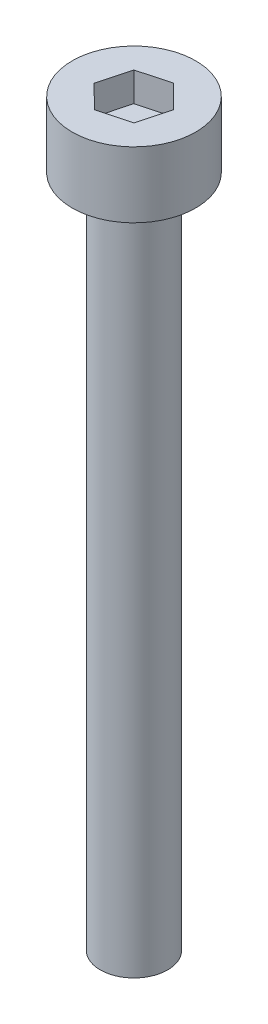
ISO-10303-21;
HEADER;
FILE_DESCRIPTION(('STEP AP214'),'2;1');
FILE_NAME('part.step','',(''),(''),'','','');
FILE_SCHEMA(('AUTOMOTIVE_DESIGN { 1 0 10303 214 1 1 1 1 }'));
ENDSEC;
DATA;
#1=APPLICATION_CONTEXT('core data for automotive mechanical design processes');
#2=APPLICATION_PROTOCOL_DEFINITION('international standard','automotive_design',2000,#1);
#3=PRODUCT_CONTEXT('',#1,'mechanical');
#4=PRODUCT('Part','Part','',(#3));
#5=PRODUCT_RELATED_PRODUCT_CATEGORY('part','',(#4));
#6=PRODUCT_DEFINITION_FORMATION('','',#4);
#7=PRODUCT_DEFINITION_CONTEXT('part definition',#1,'design');
#8=PRODUCT_DEFINITION('design','',#6,#7);
#9=PRODUCT_DEFINITION_SHAPE('','',#8);
#10=(LENGTH_UNIT() NAMED_UNIT(*) SI_UNIT(.MILLI.,.METRE.));
#11=(NAMED_UNIT(*) PLANE_ANGLE_UNIT() SI_UNIT($,.RADIAN.));
#12=(NAMED_UNIT(*) SI_UNIT($,.STERADIAN.) SOLID_ANGLE_UNIT());
#13=UNCERTAINTY_MEASURE_WITH_UNIT(LENGTH_MEASURE(1.E-05),#10,'distance_accuracy_value','');
#14=(GEOMETRIC_REPRESENTATION_CONTEXT(3) GLOBAL_UNCERTAINTY_ASSIGNED_CONTEXT((#13)) GLOBAL_UNIT_ASSIGNED_CONTEXT((#10,
#11,#12)) REPRESENTATION_CONTEXT('',''));
#15=CARTESIAN_POINT('',(0.,0.,0.));
#16=DIRECTION('',(0.,0.,1.));
#17=DIRECTION('',(1.,0.,0.));
#18=AXIS2_PLACEMENT_3D('',#15,#16,#17);
#19=CARTESIAN_POINT('',(0.,30.,0.));
#20=DIRECTION('',(0.,-1.,0.));
#21=DIRECTION('',(0.,0.,-1.));
#22=AXIS2_PLACEMENT_3D('',#19,#20,#21);
#23=CYLINDRICAL_SURFACE('',#22,1.5);
#24=CARTESIAN_POINT('',(0.,30.,0.));
#25=DIRECTION('',(0.,1.,0.));
#26=DIRECTION('',(0.,0.,1.));
#27=AXIS2_PLACEMENT_3D('',#24,#25,#26);
#28=CIRCLE('',#27,1.5);
#29=CARTESIAN_POINT('',(0.,30.,1.5));
#30=VERTEX_POINT('',#29);
#31=EDGE_CURVE('E11',#30,#30,#28,.T.);
#32=ORIENTED_EDGE('',*,*,#31,.F.);
#33=EDGE_LOOP('',(#32));
#34=FACE_BOUND('',#33,.T.);
#35=CARTESIAN_POINT('',(0.,0.,0.));
#36=DIRECTION('',(0.,1.,0.));
#37=DIRECTION('',(0.,0.,1.));
#38=AXIS2_PLACEMENT_3D('',#35,#36,#37);
#39=CIRCLE('',#38,1.5);
#40=CARTESIAN_POINT('',(0.,0.,1.5));
#41=VERTEX_POINT('',#40);
#42=EDGE_CURVE('E42',#41,#41,#39,.T.);
#43=ORIENTED_EDGE('',*,*,#42,.T.);
#44=EDGE_LOOP('',(#43));
#45=FACE_BOUND('',#44,.T.);
#46=ADVANCED_FACE('F39',(#34,#45),#23,.T.);
#47=CARTESIAN_POINT('',(0.,0.,0.));
#48=DIRECTION('',(0.,1.,0.));
#49=DIRECTION('',(0.,0.,1.));
#50=AXIS2_PLACEMENT_3D('',#47,#48,#49);
#51=PLANE('',#50);
#52=ORIENTED_EDGE('',*,*,#42,.F.);
#53=EDGE_LOOP('',(#52));
#54=FACE_BOUND('',#53,.T.);
#55=ADVANCED_FACE('F189',(#54),#51,.F.);
#56=CARTESIAN_POINT('',(0.,32.93,0.));
#57=DIRECTION('',(0.,-1.,0.));
#58=DIRECTION('',(0.,0.,-1.));
#59=AXIS2_PLACEMENT_3D('',#56,#57,#58);
#60=CYLINDRICAL_SURFACE('',#59,2.75);
#61=CARTESIAN_POINT('',(0.,32.93,0.));
#62=DIRECTION('',(0.,1.,0.));
#63=DIRECTION('',(0.,0.,1.));
#64=AXIS2_PLACEMENT_3D('',#61,#62,#63);
#65=CIRCLE('',#64,2.75);
#66=CARTESIAN_POINT('',(0.,32.93,2.75));
#67=VERTEX_POINT('',#66);
#68=EDGE_CURVE('E163',#67,#67,#65,.T.);
#69=ORIENTED_EDGE('',*,*,#68,.F.);
#70=EDGE_LOOP('',(#69));
#71=FACE_BOUND('',#70,.T.);
#72=CARTESIAN_POINT('',(0.,30.,0.));
#73=DIRECTION('',(0.,1.,0.));
#74=DIRECTION('',(0.,0.,1.));
#75=AXIS2_PLACEMENT_3D('',#72,#73,#74);
#76=CIRCLE('',#75,2.75);
#77=CARTESIAN_POINT('',(0.,30.,2.75));
#78=VERTEX_POINT('',#77);
#79=EDGE_CURVE('E153',#78,#78,#76,.T.);
#80=ORIENTED_EDGE('',*,*,#79,.T.);
#81=EDGE_LOOP('',(#80));
#82=FACE_BOUND('',#81,.T.);
#83=ADVANCED_FACE('F171',(#71,#82),#60,.T.);
#84=CARTESIAN_POINT('',(0.,32.93,0.));
#85=DIRECTION('',(0.,1.,0.));
#86=DIRECTION('',(0.,0.,1.));
#87=AXIS2_PLACEMENT_3D('',#84,#85,#86);
#88=PLANE('',#87);
#89=DIRECTION('',(0.965060636483616,0.,-0.262026654960595));
#90=VECTOR('',#89,1.);
#91=CARTESIAN_POINT('',(-0.368939204121915,32.93,1.39542724532497));
#92=LINE('',#91,#90);
#93=CARTESIAN_POINT('',(-0.368939204121915,32.93,1.39542724532497));
#94=VERTEX_POINT('',#93);
#95=CARTESIAN_POINT('',(1.0240058415234,32.93,1.01722434588407));
#96=VERTEX_POINT('',#95);
#97=EDGE_CURVE('E54',#94,#96,#92,.T.);
#98=ORIENTED_EDGE('',*,*,#97,.F.);
#99=DIRECTION('',(0.709452057906343,0.,0.704753699906893));
#100=VECTOR('',#99,1.);
#101=CARTESIAN_POINT('',(-1.39294504564532,32.93,0.378202899440891));
#102=LINE('',#101,#100);
#103=CARTESIAN_POINT('',(-1.39294504564532,32.93,0.378202899440891));
#104=VERTEX_POINT('',#103);
#105=EDGE_CURVE('E147',#104,#94,#102,.T.);
#106=ORIENTED_EDGE('',*,*,#105,.F.);
#107=DIRECTION('',(-0.255608578577273,0.,0.966780354867488));
#108=VECTOR('',#107,1.);
#109=CARTESIAN_POINT('',(-1.0240058415234,32.93,-1.01722434588407));
#110=LINE('',#109,#108);
#111=CARTESIAN_POINT('',(-1.0240058415234,32.93,-1.01722434588407));
#112=VERTEX_POINT('',#111);
#113=EDGE_CURVE('E144',#112,#104,#110,.T.);
#114=ORIENTED_EDGE('',*,*,#113,.F.);
#115=DIRECTION('',(-0.965060636483616,0.,0.262026654960595));
#116=VECTOR('',#115,1.);
#117=CARTESIAN_POINT('',(0.368939204121915,32.93,-1.39542724532496));
#118=LINE('',#117,#116);
#119=CARTESIAN_POINT('',(0.368939204121915,32.93,-1.39542724532496));
#120=VERTEX_POINT('',#119);
#121=EDGE_CURVE('E102',#120,#112,#118,.T.);
#122=ORIENTED_EDGE('',*,*,#121,.F.);
#123=DIRECTION('',(-0.709452057906343,0.,-0.704753699906893));
#124=VECTOR('',#123,1.);
#125=CARTESIAN_POINT('',(1.39294504564532,32.93,-0.378202899440891));
#126=LINE('',#125,#124);
#127=CARTESIAN_POINT('',(1.39294504564532,32.93,-0.378202899440891));
#128=VERTEX_POINT('',#127);
#129=EDGE_CURVE('E138',#128,#120,#126,.T.);
#130=ORIENTED_EDGE('',*,*,#129,.F.);
#131=DIRECTION('',(0.255608578577273,0.,-0.966780354867488));
#132=VECTOR('',#131,1.);
#133=CARTESIAN_POINT('',(1.0240058415234,32.93,1.01722434588407));
#134=LINE('',#133,#132);
#135=EDGE_CURVE('E134',#96,#128,#134,.T.);
#136=ORIENTED_EDGE('',*,*,#135,.F.);
#137=EDGE_LOOP('',(#98,#106,#114,#122,#130,#136));
#138=FACE_BOUND('',#137,.T.);
#139=ORIENTED_EDGE('',*,*,#68,.T.);
#140=EDGE_LOOP('',(#139));
#141=FACE_BOUND('',#140,.T.);
#142=ADVANCED_FACE('F176',(#138,#141),#88,.T.);
#143=CARTESIAN_POINT('',(0.,30.,0.));
#144=DIRECTION('',(0.,1.,0.));
#145=DIRECTION('',(0.,0.,1.));
#146=AXIS2_PLACEMENT_3D('',#143,#144,#145);
#147=PLANE('',#146);
#148=ORIENTED_EDGE('',*,*,#31,.T.);
#149=EDGE_LOOP('',(#148));
#150=FACE_BOUND('',#149,.T.);
#151=ORIENTED_EDGE('',*,*,#79,.F.);
#152=EDGE_LOOP('',(#151));
#153=FACE_BOUND('',#152,.T.);
#154=ADVANCED_FACE('F173',(#150,#153),#147,.F.);
#155=CARTESIAN_POINT('',(-0.368939204121915,31.63,1.39542724532497));
#156=DIRECTION('',(0.262026654960595,0.,0.965060636483616));
#157=DIRECTION('',(0.965060636483616,0.,-0.262026654960595));
#158=AXIS2_PLACEMENT_3D('',#155,#156,#157);
#159=PLANE('',#158);
#160=ORIENTED_EDGE('',*,*,#97,.T.);
#161=DIRECTION('',(0.,1.,0.));
#162=VECTOR('',#161,1.);
#163=CARTESIAN_POINT('',(1.0240058415234,31.63,1.01722434588407));
#164=LINE('',#163,#162);
#165=CARTESIAN_POINT('',(1.0240058415234,31.63,1.01722434588407));
#166=VERTEX_POINT('',#165);
#167=EDGE_CURVE('E84',#166,#96,#164,.T.);
#168=ORIENTED_EDGE('',*,*,#167,.F.);
#169=DIRECTION('',(0.965060636483616,0.,-0.262026654960595));
#170=VECTOR('',#169,1.);
#171=CARTESIAN_POINT('',(-0.368939204121915,31.63,1.39542724532497));
#172=LINE('',#171,#170);
#173=CARTESIAN_POINT('',(-0.368939204121915,31.63,1.39542724532497));
#174=VERTEX_POINT('',#173);
#175=EDGE_CURVE('E150',#174,#166,#172,.T.);
#176=ORIENTED_EDGE('',*,*,#175,.F.);
#177=DIRECTION('',(0.,1.,0.));
#178=VECTOR('',#177,1.);
#179=CARTESIAN_POINT('',(-0.368939204121915,31.63,1.39542724532497));
#180=LINE('',#179,#178);
#181=EDGE_CURVE('E62',#174,#94,#180,.T.);
#182=ORIENTED_EDGE('',*,*,#181,.T.);
#183=EDGE_LOOP('',(#160,#168,#176,#182));
#184=FACE_BOUND('',#183,.T.);
#185=ADVANCED_FACE('F175',(#184),#159,.F.);
#186=CARTESIAN_POINT('',(-1.39294504564532,31.63,0.378202899440891));
#187=DIRECTION('',(-0.704753699906893,0.,0.709452057906343));
#188=DIRECTION('',(0.709452057906343,0.,0.704753699906893));
#189=AXIS2_PLACEMENT_3D('',#186,#187,#188);
#190=PLANE('',#189);
#191=ORIENTED_EDGE('',*,*,#105,.T.);
#192=ORIENTED_EDGE('',*,*,#181,.F.);
#193=DIRECTION('',(0.709452057906343,0.,0.704753699906893));
#194=VECTOR('',#193,1.);
#195=CARTESIAN_POINT('',(-1.39294504564532,31.63,0.378202899440891));
#196=LINE('',#195,#194);
#197=CARTESIAN_POINT('',(-1.39294504564532,31.63,0.378202899440891));
#198=VERTEX_POINT('',#197);
#199=EDGE_CURVE('E116',#198,#174,#196,.T.);
#200=ORIENTED_EDGE('',*,*,#199,.F.);
#201=DIRECTION('',(0.,1.,0.));
#202=VECTOR('',#201,1.);
#203=CARTESIAN_POINT('',(-1.39294504564532,31.63,0.378202899440891));
#204=LINE('',#203,#202);
#205=EDGE_CURVE('E107',#198,#104,#204,.T.);
#206=ORIENTED_EDGE('',*,*,#205,.T.);
#207=EDGE_LOOP('',(#191,#192,#200,#206));
#208=FACE_BOUND('',#207,.T.);
#209=ADVANCED_FACE('F183',(#208),#190,.F.);
#210=CARTESIAN_POINT('',(-1.0240058415234,31.63,-1.01722434588407));
#211=DIRECTION('',(-0.966780354867488,0.,-0.255608578577273));
#212=DIRECTION('',(-0.255608578577273,0.,0.966780354867488));
#213=AXIS2_PLACEMENT_3D('',#210,#211,#212);
#214=PLANE('',#213);
#215=ORIENTED_EDGE('',*,*,#113,.T.);
#216=ORIENTED_EDGE('',*,*,#205,.F.);
#217=DIRECTION('',(-0.255608578577273,0.,0.966780354867488));
#218=VECTOR('',#217,1.);
#219=CARTESIAN_POINT('',(-1.0240058415234,31.63,-1.01722434588407));
#220=LINE('',#219,#218);
#221=CARTESIAN_POINT('',(-1.0240058415234,31.63,-1.01722434588407));
#222=VERTEX_POINT('',#221);
#223=EDGE_CURVE('E111',#222,#198,#220,.T.);
#224=ORIENTED_EDGE('',*,*,#223,.F.);
#225=DIRECTION('',(0.,1.,0.));
#226=VECTOR('',#225,1.);
#227=CARTESIAN_POINT('',(-1.0240058415234,31.63,-1.01722434588407));
#228=LINE('',#227,#226);
#229=EDGE_CURVE('E95',#222,#112,#228,.T.);
#230=ORIENTED_EDGE('',*,*,#229,.T.);
#231=EDGE_LOOP('',(#215,#216,#224,#230));
#232=FACE_BOUND('',#231,.T.);
#233=ADVANCED_FACE('F112',(#232),#214,.F.);
#234=CARTESIAN_POINT('',(0.368939204121915,31.63,-1.39542724532496));
#235=DIRECTION('',(-0.262026654960595,0.,-0.965060636483616));
#236=DIRECTION('',(-0.965060636483616,0.,0.262026654960595));
#237=AXIS2_PLACEMENT_3D('',#234,#235,#236);
#238=PLANE('',#237);
#239=ORIENTED_EDGE('',*,*,#121,.T.);
#240=ORIENTED_EDGE('',*,*,#229,.F.);
#241=DIRECTION('',(-0.965060636483616,0.,0.262026654960595));
#242=VECTOR('',#241,1.);
#243=CARTESIAN_POINT('',(0.368939204121915,31.63,-1.39542724532496));
#244=LINE('',#243,#242);
#245=CARTESIAN_POINT('',(0.368939204121915,31.63,-1.39542724532496));
#246=VERTEX_POINT('',#245);
#247=EDGE_CURVE('E99',#246,#222,#244,.T.);
#248=ORIENTED_EDGE('',*,*,#247,.F.);
#249=DIRECTION('',(0.,1.,0.));
#250=VECTOR('',#249,1.);
#251=CARTESIAN_POINT('',(0.368939204121915,31.63,-1.39542724532496));
#252=LINE('',#251,#250);
#253=EDGE_CURVE('E108',#246,#120,#252,.T.);
#254=ORIENTED_EDGE('',*,*,#253,.T.);
#255=EDGE_LOOP('',(#239,#240,#248,#254));
#256=FACE_BOUND('',#255,.T.);
#257=ADVANCED_FACE('F97',(#256),#238,.F.);
#258=CARTESIAN_POINT('',(1.39294504564532,31.63,-0.378202899440891));
#259=DIRECTION('',(0.704753699906893,0.,-0.709452057906343));
#260=DIRECTION('',(-0.709452057906343,0.,-0.704753699906893));
#261=AXIS2_PLACEMENT_3D('',#258,#259,#260);
#262=PLANE('',#261);
#263=ORIENTED_EDGE('',*,*,#129,.T.);
#264=ORIENTED_EDGE('',*,*,#253,.F.);
#265=DIRECTION('',(-0.709452057906343,0.,-0.704753699906893));
#266=VECTOR('',#265,1.);
#267=CARTESIAN_POINT('',(1.39294504564532,31.63,-0.378202899440891));
#268=LINE('',#267,#266);
#269=CARTESIAN_POINT('',(1.39294504564532,31.63,-0.378202899440891));
#270=VERTEX_POINT('',#269);
#271=EDGE_CURVE('E122',#270,#246,#268,.T.);
#272=ORIENTED_EDGE('',*,*,#271,.F.);
#273=DIRECTION('',(0.,1.,0.));
#274=VECTOR('',#273,1.);
#275=CARTESIAN_POINT('',(1.39294504564532,31.63,-0.378202899440891));
#276=LINE('',#275,#274);
#277=EDGE_CURVE('E158',#270,#128,#276,.T.);
#278=ORIENTED_EDGE('',*,*,#277,.T.);
#279=EDGE_LOOP('',(#263,#264,#272,#278));
#280=FACE_BOUND('',#279,.T.);
#281=ADVANCED_FACE('F245',(#280),#262,.F.);
#282=CARTESIAN_POINT('',(1.0240058415234,31.63,1.01722434588407));
#283=DIRECTION('',(0.966780354867488,0.,0.255608578577273));
#284=DIRECTION('',(0.255608578577273,0.,-0.966780354867488));
#285=AXIS2_PLACEMENT_3D('',#282,#283,#284);
#286=PLANE('',#285);
#287=ORIENTED_EDGE('',*,*,#135,.T.);
#288=ORIENTED_EDGE('',*,*,#277,.F.);
#289=DIRECTION('',(0.255608578577273,0.,-0.966780354867488));
#290=VECTOR('',#289,1.);
#291=CARTESIAN_POINT('',(1.0240058415234,31.63,1.01722434588407));
#292=LINE('',#291,#290);
#293=EDGE_CURVE('E126',#166,#270,#292,.T.);
#294=ORIENTED_EDGE('',*,*,#293,.F.);
#295=ORIENTED_EDGE('',*,*,#167,.T.);
#296=EDGE_LOOP('',(#287,#288,#294,#295));
#297=FACE_BOUND('',#296,.T.);
#298=ADVANCED_FACE('F254',(#297),#286,.F.);
#299=CARTESIAN_POINT('',(0.,31.63,0.));
#300=DIRECTION('',(0.,1.,0.));
#301=DIRECTION('',(0.,0.,1.));
#302=AXIS2_PLACEMENT_3D('',#299,#300,#301);
#303=PLANE('',#302);
#304=ORIENTED_EDGE('',*,*,#175,.T.);
#305=ORIENTED_EDGE('',*,*,#293,.T.);
#306=ORIENTED_EDGE('',*,*,#271,.T.);
#307=ORIENTED_EDGE('',*,*,#247,.T.);
#308=ORIENTED_EDGE('',*,*,#223,.T.);
#309=ORIENTED_EDGE('',*,*,#199,.T.);
#310=EDGE_LOOP('',(#304,#305,#306,#307,#308,#309));
#311=FACE_BOUND('',#310,.T.);
#312=ADVANCED_FACE('F119',(#311),#303,.T.);
#313=CLOSED_SHELL('',(#46,#55,#83,#142,#154,#185,#209,#233,#257,#281,#298,#312));
#314=MANIFOLD_SOLID_BREP('B2',#313);
#315=ADVANCED_BREP_SHAPE_REPRESENTATION('',(#18,#314),#14);
#316=SHAPE_DEFINITION_REPRESENTATION(#9,#315);
ENDSEC;
END-ISO-10303-21;
